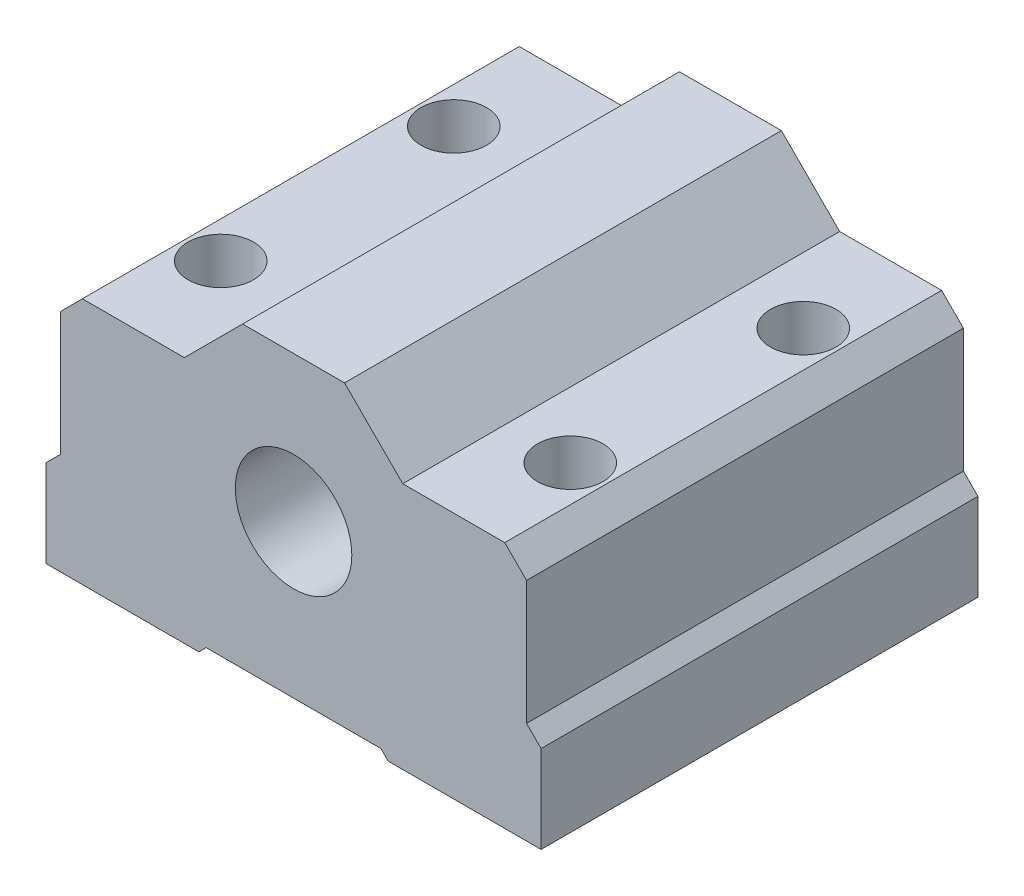
ISO-10303-21;
HEADER;
FILE_DESCRIPTION(('STEP AP214'),'2;1');
FILE_NAME('part.step','',(''),(''),'','','');
FILE_SCHEMA(('AUTOMOTIVE_DESIGN { 1 0 10303 214 1 1 1 1 }'));
ENDSEC;
DATA;
#1=APPLICATION_CONTEXT('core data for automotive mechanical design processes');
#2=APPLICATION_PROTOCOL_DEFINITION('international standard','automotive_design',2000,#1);
#3=PRODUCT_CONTEXT('',#1,'mechanical');
#4=PRODUCT('Part','Part','',(#3));
#5=PRODUCT_RELATED_PRODUCT_CATEGORY('part','',(#4));
#6=PRODUCT_DEFINITION_FORMATION('','',#4);
#7=PRODUCT_DEFINITION_CONTEXT('part definition',#1,'design');
#8=PRODUCT_DEFINITION('design','',#6,#7);
#9=PRODUCT_DEFINITION_SHAPE('','',#8);
#10=(LENGTH_UNIT() NAMED_UNIT(*) SI_UNIT(.MILLI.,.METRE.));
#11=(NAMED_UNIT(*) PLANE_ANGLE_UNIT() SI_UNIT($,.RADIAN.));
#12=(NAMED_UNIT(*) SI_UNIT($,.STERADIAN.) SOLID_ANGLE_UNIT());
#13=UNCERTAINTY_MEASURE_WITH_UNIT(LENGTH_MEASURE(1.E-05),#10,'distance_accuracy_value','');
#14=(GEOMETRIC_REPRESENTATION_CONTEXT(3) GLOBAL_UNCERTAINTY_ASSIGNED_CONTEXT((#13)) GLOBAL_UNIT_ASSIGNED_CONTEXT((#10,
#11,#12)) REPRESENTATION_CONTEXT('',''));
#15=CARTESIAN_POINT('',(0.,0.,0.));
#16=DIRECTION('',(0.,0.,1.));
#17=DIRECTION('',(1.,0.,0.));
#18=AXIS2_PLACEMENT_3D('',#15,#16,#17);
#19=CARTESIAN_POINT('',(-6.00000000000002,6.00000000000001,-15.));
#20=DIRECTION('',(-0.707106781186548,0.707106781186547,0.));
#21=DIRECTION('',(-0.707106781186547,-0.707106781186548,0.));
#22=AXIS2_PLACEMENT_3D('',#19,#20,#21);
#23=PLANE('',#22);
#24=DIRECTION('',(0.,0.,1.));
#25=VECTOR('',#24,1.);
#26=CARTESIAN_POINT('',(-17.,-5.,-15.));
#27=LINE('',#26,#25);
#28=CARTESIAN_POINT('',(-17.,-5.,-15.));
#29=VERTEX_POINT('',#28);
#30=CARTESIAN_POINT('',(-17.,-5.,15.));
#31=VERTEX_POINT('',#30);
#32=EDGE_CURVE('E39',#29,#31,#27,.T.);
#33=ORIENTED_EDGE('',*,*,#32,.T.);
#34=DIRECTION('',(-0.707106781186547,-0.707106781186548,0.));
#35=VECTOR('',#34,1.);
#36=CARTESIAN_POINT('',(-6.00000000000002,6.00000000000001,15.));
#37=LINE('',#36,#35);
#38=CARTESIAN_POINT('',(-16.,-4.,15.));
#39=VERTEX_POINT('',#38);
#40=EDGE_CURVE('E160',#39,#31,#37,.T.);
#41=ORIENTED_EDGE('',*,*,#40,.F.);
#42=DIRECTION('',(0.,0.,1.));
#43=VECTOR('',#42,1.);
#44=CARTESIAN_POINT('',(-16.,-4.,-15.));
#45=LINE('',#44,#43);
#46=CARTESIAN_POINT('',(-16.,-4.,-15.));
#47=VERTEX_POINT('',#46);
#48=EDGE_CURVE('E11',#47,#39,#45,.T.);
#49=ORIENTED_EDGE('',*,*,#48,.F.);
#50=DIRECTION('',(-0.707106781186547,-0.707106781186548,0.));
#51=VECTOR('',#50,1.);
#52=CARTESIAN_POINT('',(-6.00000000000002,6.00000000000001,-15.));
#53=LINE('',#52,#51);
#54=EDGE_CURVE('E161',#47,#29,#53,.T.);
#55=ORIENTED_EDGE('',*,*,#54,.T.);
#56=EDGE_LOOP('',(#33,#41,#49,#55));
#57=FACE_BOUND('',#56,.T.);
#58=ADVANCED_FACE('F35',(#57),#23,.T.);
#59=CARTESIAN_POINT('',(-16.,0.,-15.));
#60=DIRECTION('',(-1.,0.,0.));
#61=DIRECTION('',(0.,0.,1.));
#62=AXIS2_PLACEMENT_3D('',#59,#60,#61);
#63=PLANE('',#62);
#64=ORIENTED_EDGE('',*,*,#48,.T.);
#65=DIRECTION('',(0.,-1.,0.));
#66=VECTOR('',#65,1.);
#67=CARTESIAN_POINT('',(-16.,0.,15.));
#68=LINE('',#67,#66);
#69=CARTESIAN_POINT('',(-16.,4.5,15.));
#70=VERTEX_POINT('',#69);
#71=EDGE_CURVE('E178',#70,#39,#68,.T.);
#72=ORIENTED_EDGE('',*,*,#71,.F.);
#73=DIRECTION('',(0.,0.,1.));
#74=VECTOR('',#73,1.);
#75=CARTESIAN_POINT('',(-16.,4.5,-15.));
#76=LINE('',#75,#74);
#77=CARTESIAN_POINT('',(-16.,4.5,-15.));
#78=VERTEX_POINT('',#77);
#79=EDGE_CURVE('E44',#78,#70,#76,.T.);
#80=ORIENTED_EDGE('',*,*,#79,.F.);
#81=DIRECTION('',(0.,-1.,0.));
#82=VECTOR('',#81,1.);
#83=CARTESIAN_POINT('',(-16.,0.,-15.));
#84=LINE('',#83,#82);
#85=EDGE_CURVE('E166',#78,#47,#84,.T.);
#86=ORIENTED_EDGE('',*,*,#85,.T.);
#87=EDGE_LOOP('',(#64,#72,#80,#86));
#88=FACE_BOUND('',#87,.T.);
#89=ADVANCED_FACE('F370',(#88),#63,.T.);
#90=CARTESIAN_POINT('',(-10.25,10.25,-15.));
#91=DIRECTION('',(-0.707106781186547,0.707106781186547,0.));
#92=DIRECTION('',(-0.707106781186548,-0.707106781186548,0.));
#93=AXIS2_PLACEMENT_3D('',#90,#91,#92);
#94=PLANE('',#93);
#95=ORIENTED_EDGE('',*,*,#79,.T.);
#96=DIRECTION('',(-0.707106781186548,-0.707106781186548,0.));
#97=VECTOR('',#96,1.);
#98=CARTESIAN_POINT('',(-10.25,10.25,15.));
#99=LINE('',#98,#97);
#100=CARTESIAN_POINT('',(-14.5,6.,15.));
#101=VERTEX_POINT('',#100);
#102=EDGE_CURVE('E226',#101,#70,#99,.T.);
#103=ORIENTED_EDGE('',*,*,#102,.F.);
#104=DIRECTION('',(0.,0.,1.));
#105=VECTOR('',#104,1.);
#106=CARTESIAN_POINT('',(-14.5,6.,-15.));
#107=LINE('',#106,#105);
#108=CARTESIAN_POINT('',(-14.5,6.,-15.));
#109=VERTEX_POINT('',#108);
#110=EDGE_CURVE('E281',#109,#101,#107,.T.);
#111=ORIENTED_EDGE('',*,*,#110,.F.);
#112=DIRECTION('',(-0.707106781186548,-0.707106781186548,0.));
#113=VECTOR('',#112,1.);
#114=CARTESIAN_POINT('',(-10.25,10.25,-15.));
#115=LINE('',#114,#113);
#116=EDGE_CURVE('E277',#109,#78,#115,.T.);
#117=ORIENTED_EDGE('',*,*,#116,.T.);
#118=EDGE_LOOP('',(#95,#103,#111,#117));
#119=FACE_BOUND('',#118,.T.);
#120=ADVANCED_FACE('F368',(#119),#94,.T.);
#121=CARTESIAN_POINT('',(0.,6.,-15.));
#122=DIRECTION('',(0.,1.,0.));
#123=DIRECTION('',(0.,0.,1.));
#124=AXIS2_PLACEMENT_3D('',#121,#122,#123);
#125=PLANE('',#124);
#126=CARTESIAN_POINT('',(-12.,6.,-8.));
#127=DIRECTION('',(0.,1.,0.));
#128=DIRECTION('',(0.,0.,1.));
#129=AXIS2_PLACEMENT_3D('',#126,#127,#128);
#130=CIRCLE('',#129,2.24999999999999);
#131=CARTESIAN_POINT('',(-12.,6.,-5.75000000000001));
#132=VERTEX_POINT('',#131);
#133=EDGE_CURVE('E453',#132,#132,#130,.T.);
#134=ORIENTED_EDGE('',*,*,#133,.F.);
#135=EDGE_LOOP('',(#134));
#136=FACE_BOUND('',#135,.T.);
#137=CARTESIAN_POINT('',(-12.,6.,8.));
#138=DIRECTION('',(0.,1.,0.));
#139=DIRECTION('',(0.,0.,1.));
#140=AXIS2_PLACEMENT_3D('',#137,#138,#139);
#141=CIRCLE('',#140,2.24999999999999);
#142=CARTESIAN_POINT('',(-12.,6.,10.25));
#143=VERTEX_POINT('',#142);
#144=EDGE_CURVE('E469',#143,#143,#141,.T.);
#145=ORIENTED_EDGE('',*,*,#144,.F.);
#146=EDGE_LOOP('',(#145));
#147=FACE_BOUND('',#146,.T.);
#148=ORIENTED_EDGE('',*,*,#110,.T.);
#149=DIRECTION('',(-1.,0.,0.));
#150=VECTOR('',#149,1.);
#151=CARTESIAN_POINT('',(0.,6.,15.));
#152=LINE('',#151,#150);
#153=CARTESIAN_POINT('',(-7.5,6.,15.));
#154=VERTEX_POINT('',#153);
#155=EDGE_CURVE('E223',#154,#101,#152,.T.);
#156=ORIENTED_EDGE('',*,*,#155,.F.);
#157=DIRECTION('',(0.,0.,1.));
#158=VECTOR('',#157,1.);
#159=CARTESIAN_POINT('',(-7.5,6.,-15.));
#160=LINE('',#159,#158);
#161=CARTESIAN_POINT('',(-7.5,6.,-15.));
#162=VERTEX_POINT('',#161);
#163=EDGE_CURVE('E283',#162,#154,#160,.T.);
#164=ORIENTED_EDGE('',*,*,#163,.F.);
#165=DIRECTION('',(-1.,0.,0.));
#166=VECTOR('',#165,1.);
#167=CARTESIAN_POINT('',(0.,6.,-15.));
#168=LINE('',#167,#166);
#169=EDGE_CURVE('E274',#162,#109,#168,.T.);
#170=ORIENTED_EDGE('',*,*,#169,.T.);
#171=EDGE_LOOP('',(#148,#156,#164,#170));
#172=FACE_BOUND('',#171,.T.);
#173=ADVANCED_FACE('F366',(#136,#147,#172),#125,.T.);
#174=CARTESIAN_POINT('',(-6.75,6.75,-15.));
#175=DIRECTION('',(-0.707106781186548,0.707106781186547,0.));
#176=DIRECTION('',(-0.707106781186547,-0.707106781186548,0.));
#177=AXIS2_PLACEMENT_3D('',#174,#175,#176);
#178=PLANE('',#177);
#179=ORIENTED_EDGE('',*,*,#163,.T.);
#180=DIRECTION('',(-0.707106781186547,-0.707106781186548,0.));
#181=VECTOR('',#180,1.);
#182=CARTESIAN_POINT('',(-6.75,6.75,15.));
#183=LINE('',#182,#181);
#184=CARTESIAN_POINT('',(-3.5,10.,15.));
#185=VERTEX_POINT('',#184);
#186=EDGE_CURVE('E220',#185,#154,#183,.T.);
#187=ORIENTED_EDGE('',*,*,#186,.F.);
#188=DIRECTION('',(0.,0.,1.));
#189=VECTOR('',#188,1.);
#190=CARTESIAN_POINT('',(-3.5,10.,-15.));
#191=LINE('',#190,#189);
#192=CARTESIAN_POINT('',(-3.5,10.,-15.));
#193=VERTEX_POINT('',#192);
#194=EDGE_CURVE('E285',#193,#185,#191,.T.);
#195=ORIENTED_EDGE('',*,*,#194,.F.);
#196=DIRECTION('',(-0.707106781186547,-0.707106781186548,0.));
#197=VECTOR('',#196,1.);
#198=CARTESIAN_POINT('',(-6.75,6.75,-15.));
#199=LINE('',#198,#197);
#200=EDGE_CURVE('E271',#193,#162,#199,.T.);
#201=ORIENTED_EDGE('',*,*,#200,.T.);
#202=EDGE_LOOP('',(#179,#187,#195,#201));
#203=FACE_BOUND('',#202,.T.);
#204=ADVANCED_FACE('F361',(#203),#178,.T.);
#205=CARTESIAN_POINT('',(0.,10.,-15.));
#206=DIRECTION('',(0.,1.,0.));
#207=DIRECTION('',(0.,0.,1.));
#208=AXIS2_PLACEMENT_3D('',#205,#206,#207);
#209=PLANE('',#208);
#210=ORIENTED_EDGE('',*,*,#194,.T.);
#211=DIRECTION('',(-1.,0.,0.));
#212=VECTOR('',#211,1.);
#213=CARTESIAN_POINT('',(0.,10.,15.));
#214=LINE('',#213,#212);
#215=CARTESIAN_POINT('',(3.5,10.,15.));
#216=VERTEX_POINT('',#215);
#217=EDGE_CURVE('E217',#216,#185,#214,.T.);
#218=ORIENTED_EDGE('',*,*,#217,.F.);
#219=DIRECTION('',(0.,0.,1.));
#220=VECTOR('',#219,1.);
#221=CARTESIAN_POINT('',(3.5,10.,-15.));
#222=LINE('',#221,#220);
#223=CARTESIAN_POINT('',(3.5,10.,-15.));
#224=VERTEX_POINT('',#223);
#225=EDGE_CURVE('E287',#224,#216,#222,.T.);
#226=ORIENTED_EDGE('',*,*,#225,.F.);
#227=DIRECTION('',(-1.,0.,0.));
#228=VECTOR('',#227,1.);
#229=CARTESIAN_POINT('',(0.,10.,-15.));
#230=LINE('',#229,#228);
#231=EDGE_CURVE('E268',#224,#193,#230,.T.);
#232=ORIENTED_EDGE('',*,*,#231,.T.);
#233=EDGE_LOOP('',(#210,#218,#226,#232));
#234=FACE_BOUND('',#233,.T.);
#235=ADVANCED_FACE('F356',(#234),#209,.T.);
#236=CARTESIAN_POINT('',(6.75,6.75,-15.));
#237=DIRECTION('',(0.707106781186548,0.707106781186547,0.));
#238=DIRECTION('',(-0.707106781186547,0.707106781186548,0.));
#239=AXIS2_PLACEMENT_3D('',#236,#237,#238);
#240=PLANE('',#239);
#241=ORIENTED_EDGE('',*,*,#225,.T.);
#242=DIRECTION('',(-0.707106781186547,0.707106781186548,0.));
#243=VECTOR('',#242,1.);
#244=CARTESIAN_POINT('',(6.75,6.75,15.));
#245=LINE('',#244,#243);
#246=CARTESIAN_POINT('',(7.5,6.00000000000001,15.));
#247=VERTEX_POINT('',#246);
#248=EDGE_CURVE('E214',#247,#216,#245,.T.);
#249=ORIENTED_EDGE('',*,*,#248,.F.);
#250=DIRECTION('',(0.,0.,1.));
#251=VECTOR('',#250,1.);
#252=CARTESIAN_POINT('',(7.5,6.00000000000001,-15.));
#253=LINE('',#252,#251);
#254=CARTESIAN_POINT('',(7.5,6.00000000000001,-15.));
#255=VERTEX_POINT('',#254);
#256=EDGE_CURVE('E289',#255,#247,#253,.T.);
#257=ORIENTED_EDGE('',*,*,#256,.F.);
#258=DIRECTION('',(-0.707106781186547,0.707106781186548,0.));
#259=VECTOR('',#258,1.);
#260=CARTESIAN_POINT('',(6.75,6.75,-15.));
#261=LINE('',#260,#259);
#262=EDGE_CURVE('E265',#255,#224,#261,.T.);
#263=ORIENTED_EDGE('',*,*,#262,.T.);
#264=EDGE_LOOP('',(#241,#249,#257,#263));
#265=FACE_BOUND('',#264,.T.);
#266=ADVANCED_FACE('F354',(#265),#240,.T.);
#267=CARTESIAN_POINT('',(0.,6.,-15.));
#268=DIRECTION('',(0.,1.,0.));
#269=DIRECTION('',(-1.,0.,0.));
#270=AXIS2_PLACEMENT_3D('',#267,#268,#269);
#271=PLANE('',#270);
#272=CARTESIAN_POINT('',(12.,6.,-8.));
#273=DIRECTION('',(0.,1.,0.));
#274=DIRECTION('',(0.,0.,1.));
#275=AXIS2_PLACEMENT_3D('',#272,#273,#274);
#276=CIRCLE('',#275,2.24999999999999);
#277=CARTESIAN_POINT('',(12.,6.,-5.75000000000001));
#278=VERTEX_POINT('',#277);
#279=EDGE_CURVE('E455',#278,#278,#276,.T.);
#280=ORIENTED_EDGE('',*,*,#279,.F.);
#281=EDGE_LOOP('',(#280));
#282=FACE_BOUND('',#281,.T.);
#283=CARTESIAN_POINT('',(12.,6.,8.));
#284=DIRECTION('',(0.,1.,0.));
#285=DIRECTION('',(0.,0.,1.));
#286=AXIS2_PLACEMENT_3D('',#283,#284,#285);
#287=CIRCLE('',#286,2.24999999999999);
#288=CARTESIAN_POINT('',(12.,6.,10.25));
#289=VERTEX_POINT('',#288);
#290=EDGE_CURVE('E463',#289,#289,#287,.T.);
#291=ORIENTED_EDGE('',*,*,#290,.F.);
#292=EDGE_LOOP('',(#291));
#293=FACE_BOUND('',#292,.T.);
#294=ORIENTED_EDGE('',*,*,#256,.T.);
#295=DIRECTION('',(-1.,0.,0.));
#296=VECTOR('',#295,1.);
#297=CARTESIAN_POINT('',(0.,6.,15.));
#298=LINE('',#297,#296);
#299=CARTESIAN_POINT('',(14.5,6.00000000000001,15.));
#300=VERTEX_POINT('',#299);
#301=EDGE_CURVE('E211',#300,#247,#298,.T.);
#302=ORIENTED_EDGE('',*,*,#301,.F.);
#303=DIRECTION('',(0.,0.,1.));
#304=VECTOR('',#303,1.);
#305=CARTESIAN_POINT('',(14.5,6.00000000000001,-15.));
#306=LINE('',#305,#304);
#307=CARTESIAN_POINT('',(14.5,6.00000000000001,-15.));
#308=VERTEX_POINT('',#307);
#309=EDGE_CURVE('E291',#308,#300,#306,.T.);
#310=ORIENTED_EDGE('',*,*,#309,.F.);
#311=DIRECTION('',(-1.,0.,0.));
#312=VECTOR('',#311,1.);
#313=CARTESIAN_POINT('',(0.,6.,-15.));
#314=LINE('',#313,#312);
#315=EDGE_CURVE('E262',#308,#255,#314,.T.);
#316=ORIENTED_EDGE('',*,*,#315,.T.);
#317=EDGE_LOOP('',(#294,#302,#310,#316));
#318=FACE_BOUND('',#317,.T.);
#319=ADVANCED_FACE('F349',(#282,#293,#318),#271,.T.);
#320=CARTESIAN_POINT('',(10.25,10.25,-15.));
#321=DIRECTION('',(0.707106781186547,0.707106781186548,0.));
#322=DIRECTION('',(-0.707106781186548,0.707106781186547,0.));
#323=AXIS2_PLACEMENT_3D('',#320,#321,#322);
#324=PLANE('',#323);
#325=ORIENTED_EDGE('',*,*,#309,.T.);
#326=DIRECTION('',(-0.707106781186548,0.707106781186547,0.));
#327=VECTOR('',#326,1.);
#328=CARTESIAN_POINT('',(10.25,10.25,15.));
#329=LINE('',#328,#327);
#330=CARTESIAN_POINT('',(16.,4.50000000000001,15.));
#331=VERTEX_POINT('',#330);
#332=EDGE_CURVE('E208',#331,#300,#329,.T.);
#333=ORIENTED_EDGE('',*,*,#332,.F.);
#334=DIRECTION('',(0.,0.,1.));
#335=VECTOR('',#334,1.);
#336=CARTESIAN_POINT('',(16.,4.50000000000001,-15.));
#337=LINE('',#336,#335);
#338=CARTESIAN_POINT('',(16.,4.50000000000001,-15.));
#339=VERTEX_POINT('',#338);
#340=EDGE_CURVE('E293',#339,#331,#337,.T.);
#341=ORIENTED_EDGE('',*,*,#340,.F.);
#342=DIRECTION('',(-0.707106781186548,0.707106781186547,0.));
#343=VECTOR('',#342,1.);
#344=CARTESIAN_POINT('',(10.25,10.25,-15.));
#345=LINE('',#344,#343);
#346=EDGE_CURVE('E259',#339,#308,#345,.T.);
#347=ORIENTED_EDGE('',*,*,#346,.T.);
#348=EDGE_LOOP('',(#325,#333,#341,#347));
#349=FACE_BOUND('',#348,.T.);
#350=ADVANCED_FACE('F344',(#349),#324,.T.);
#351=CARTESIAN_POINT('',(16.,0.,-15.));
#352=DIRECTION('',(1.,0.,0.));
#353=DIRECTION('',(0.,0.,-1.));
#354=AXIS2_PLACEMENT_3D('',#351,#352,#353);
#355=PLANE('',#354);
#356=ORIENTED_EDGE('',*,*,#340,.T.);
#357=DIRECTION('',(0.,1.,0.));
#358=VECTOR('',#357,1.);
#359=CARTESIAN_POINT('',(16.,0.,15.));
#360=LINE('',#359,#358);
#361=CARTESIAN_POINT('',(16.,-3.99999999999999,15.));
#362=VERTEX_POINT('',#361);
#363=EDGE_CURVE('E205',#362,#331,#360,.T.);
#364=ORIENTED_EDGE('',*,*,#363,.F.);
#365=DIRECTION('',(0.,0.,1.));
#366=VECTOR('',#365,1.);
#367=CARTESIAN_POINT('',(16.,-3.99999999999999,-15.));
#368=LINE('',#367,#366);
#369=CARTESIAN_POINT('',(16.,-3.99999999999999,-15.));
#370=VERTEX_POINT('',#369);
#371=EDGE_CURVE('E295',#370,#362,#368,.T.);
#372=ORIENTED_EDGE('',*,*,#371,.F.);
#373=DIRECTION('',(0.,1.,0.));
#374=VECTOR('',#373,1.);
#375=CARTESIAN_POINT('',(16.,0.,-15.));
#376=LINE('',#375,#374);
#377=EDGE_CURVE('E256',#370,#339,#376,.T.);
#378=ORIENTED_EDGE('',*,*,#377,.T.);
#379=EDGE_LOOP('',(#356,#364,#372,#378));
#380=FACE_BOUND('',#379,.T.);
#381=ADVANCED_FACE('F342',(#380),#355,.T.);
#382=CARTESIAN_POINT('',(6.00000000000006,6.00000000000002,-15.));
#383=DIRECTION('',(0.70710678118655,0.707106781186545,0.));
#384=DIRECTION('',(-0.707106781186545,0.70710678118655,0.));
#385=AXIS2_PLACEMENT_3D('',#382,#383,#384);
#386=PLANE('',#385);
#387=ORIENTED_EDGE('',*,*,#371,.T.);
#388=DIRECTION('',(-0.707106781186545,0.70710678118655,0.));
#389=VECTOR('',#388,1.);
#390=CARTESIAN_POINT('',(6.00000000000006,6.00000000000002,15.));
#391=LINE('',#390,#389);
#392=CARTESIAN_POINT('',(17.,-5.,15.));
#393=VERTEX_POINT('',#392);
#394=EDGE_CURVE('E202',#393,#362,#391,.T.);
#395=ORIENTED_EDGE('',*,*,#394,.F.);
#396=DIRECTION('',(0.,0.,1.));
#397=VECTOR('',#396,1.);
#398=CARTESIAN_POINT('',(17.,-5.,-15.));
#399=LINE('',#398,#397);
#400=CARTESIAN_POINT('',(17.,-5.,-15.));
#401=VERTEX_POINT('',#400);
#402=EDGE_CURVE('E297',#401,#393,#399,.T.);
#403=ORIENTED_EDGE('',*,*,#402,.F.);
#404=DIRECTION('',(-0.707106781186545,0.70710678118655,0.));
#405=VECTOR('',#404,1.);
#406=CARTESIAN_POINT('',(6.00000000000006,6.00000000000002,-15.));
#407=LINE('',#406,#405);
#408=EDGE_CURVE('E253',#401,#370,#407,.T.);
#409=ORIENTED_EDGE('',*,*,#408,.T.);
#410=EDGE_LOOP('',(#387,#395,#403,#409));
#411=FACE_BOUND('',#410,.T.);
#412=ADVANCED_FACE('F337',(#411),#386,.T.);
#413=CARTESIAN_POINT('',(17.,0.,-15.));
#414=DIRECTION('',(1.,0.,0.));
#415=DIRECTION('',(0.,0.,-1.));
#416=AXIS2_PLACEMENT_3D('',#413,#414,#415);
#417=PLANE('',#416);
#418=ORIENTED_EDGE('',*,*,#402,.T.);
#419=DIRECTION('',(0.,1.,0.));
#420=VECTOR('',#419,1.);
#421=CARTESIAN_POINT('',(17.,0.,15.));
#422=LINE('',#421,#420);
#423=CARTESIAN_POINT('',(17.,-11.,15.));
#424=VERTEX_POINT('',#423);
#425=EDGE_CURVE('E199',#424,#393,#422,.T.);
#426=ORIENTED_EDGE('',*,*,#425,.F.);
#427=DIRECTION('',(0.,0.,1.));
#428=VECTOR('',#427,1.);
#429=CARTESIAN_POINT('',(17.,-11.,-15.));
#430=LINE('',#429,#428);
#431=CARTESIAN_POINT('',(17.,-11.,-15.));
#432=VERTEX_POINT('',#431);
#433=EDGE_CURVE('E299',#432,#424,#430,.T.);
#434=ORIENTED_EDGE('',*,*,#433,.F.);
#435=DIRECTION('',(0.,1.,0.));
#436=VECTOR('',#435,1.);
#437=CARTESIAN_POINT('',(17.,0.,-15.));
#438=LINE('',#437,#436);
#439=EDGE_CURVE('E250',#432,#401,#438,.T.);
#440=ORIENTED_EDGE('',*,*,#439,.T.);
#441=EDGE_LOOP('',(#418,#426,#434,#440));
#442=FACE_BOUND('',#441,.T.);
#443=ADVANCED_FACE('F332',(#442),#417,.T.);
#444=CARTESIAN_POINT('',(0.,-11.,-15.));
#445=DIRECTION('',(0.,-1.,0.));
#446=DIRECTION('',(1.,0.,0.));
#447=AXIS2_PLACEMENT_3D('',#444,#445,#446);
#448=PLANE('',#447);
#449=CARTESIAN_POINT('',(12.,-11.,-8.));
#450=DIRECTION('',(0.,1.,0.));
#451=DIRECTION('',(0.,0.,1.));
#452=AXIS2_PLACEMENT_3D('',#449,#450,#451);
#453=CIRCLE('',#452,2.25);
#454=CARTESIAN_POINT('',(12.,-11.,-5.75));
#455=VERTEX_POINT('',#454);
#456=EDGE_CURVE('E460',#455,#455,#453,.T.);
#457=ORIENTED_EDGE('',*,*,#456,.T.);
#458=EDGE_LOOP('',(#457));
#459=FACE_BOUND('',#458,.T.);
#460=CARTESIAN_POINT('',(12.,-11.,8.));
#461=DIRECTION('',(0.,1.,0.));
#462=DIRECTION('',(0.,0.,1.));
#463=AXIS2_PLACEMENT_3D('',#460,#461,#462);
#464=CIRCLE('',#463,2.25);
#465=CARTESIAN_POINT('',(12.,-11.,10.25));
#466=VERTEX_POINT('',#465);
#467=EDGE_CURVE('E466',#466,#466,#464,.T.);
#468=ORIENTED_EDGE('',*,*,#467,.T.);
#469=EDGE_LOOP('',(#468));
#470=FACE_BOUND('',#469,.T.);
#471=ORIENTED_EDGE('',*,*,#433,.T.);
#472=DIRECTION('',(1.,0.,0.));
#473=VECTOR('',#472,1.);
#474=CARTESIAN_POINT('',(0.,-11.,15.));
#475=LINE('',#474,#473);
#476=CARTESIAN_POINT('',(6.5,-11.,15.));
#477=VERTEX_POINT('',#476);
#478=EDGE_CURVE('E196',#477,#424,#475,.T.);
#479=ORIENTED_EDGE('',*,*,#478,.F.);
#480=DIRECTION('',(0.,0.,1.));
#481=VECTOR('',#480,1.);
#482=CARTESIAN_POINT('',(6.5,-11.,-15.));
#483=LINE('',#482,#481);
#484=CARTESIAN_POINT('',(6.5,-11.,-15.));
#485=VERTEX_POINT('',#484);
#486=EDGE_CURVE('E301',#485,#477,#483,.T.);
#487=ORIENTED_EDGE('',*,*,#486,.F.);
#488=DIRECTION('',(1.,0.,0.));
#489=VECTOR('',#488,1.);
#490=CARTESIAN_POINT('',(0.,-11.,-15.));
#491=LINE('',#490,#489);
#492=EDGE_CURVE('E247',#485,#432,#491,.T.);
#493=ORIENTED_EDGE('',*,*,#492,.T.);
#494=EDGE_LOOP('',(#471,#479,#487,#493));
#495=FACE_BOUND('',#494,.T.);
#496=ADVANCED_FACE('F330',(#459,#470,#495),#448,.T.);
#497=CARTESIAN_POINT('',(-2.25,-2.25,-15.));
#498=DIRECTION('',(-0.707106781186547,-0.707106781186547,0.));
#499=DIRECTION('',(0.707106781186548,-0.707106781186548,0.));
#500=AXIS2_PLACEMENT_3D('',#497,#498,#499);
#501=PLANE('',#500);
#502=ORIENTED_EDGE('',*,*,#486,.T.);
#503=DIRECTION('',(0.707106781186548,-0.707106781186548,0.));
#504=VECTOR('',#503,1.);
#505=CARTESIAN_POINT('',(-2.25,-2.25,15.));
#506=LINE('',#505,#504);
#507=CARTESIAN_POINT('',(6.,-10.5,15.));
#508=VERTEX_POINT('',#507);
#509=EDGE_CURVE('E193',#508,#477,#506,.T.);
#510=ORIENTED_EDGE('',*,*,#509,.F.);
#511=DIRECTION('',(0.,0.,1.));
#512=VECTOR('',#511,1.);
#513=CARTESIAN_POINT('',(6.,-10.5,-15.));
#514=LINE('',#513,#512);
#515=CARTESIAN_POINT('',(6.,-10.5,-15.));
#516=VERTEX_POINT('',#515);
#517=EDGE_CURVE('E303',#516,#508,#514,.T.);
#518=ORIENTED_EDGE('',*,*,#517,.F.);
#519=DIRECTION('',(0.707106781186548,-0.707106781186548,0.));
#520=VECTOR('',#519,1.);
#521=CARTESIAN_POINT('',(-2.25,-2.25,-15.));
#522=LINE('',#521,#520);
#523=EDGE_CURVE('E244',#516,#485,#522,.T.);
#524=ORIENTED_EDGE('',*,*,#523,.T.);
#525=EDGE_LOOP('',(#502,#510,#518,#524));
#526=FACE_BOUND('',#525,.T.);
#527=ADVANCED_FACE('F325',(#526),#501,.T.);
#528=CARTESIAN_POINT('',(0.,-10.5,-15.));
#529=DIRECTION('',(0.,-1.,0.));
#530=DIRECTION('',(1.,0.,0.));
#531=AXIS2_PLACEMENT_3D('',#528,#529,#530);
#532=PLANE('',#531);
#533=ORIENTED_EDGE('',*,*,#517,.T.);
#534=DIRECTION('',(1.,0.,0.));
#535=VECTOR('',#534,1.);
#536=CARTESIAN_POINT('',(0.,-10.5,15.));
#537=LINE('',#536,#535);
#538=CARTESIAN_POINT('',(-6.,-10.5,15.));
#539=VERTEX_POINT('',#538);
#540=EDGE_CURVE('E190',#539,#508,#537,.T.);
#541=ORIENTED_EDGE('',*,*,#540,.F.);
#542=DIRECTION('',(0.,0.,1.));
#543=VECTOR('',#542,1.);
#544=CARTESIAN_POINT('',(-6.,-10.5,-15.));
#545=LINE('',#544,#543);
#546=CARTESIAN_POINT('',(-6.,-10.5,-15.));
#547=VERTEX_POINT('',#546);
#548=EDGE_CURVE('E305',#547,#539,#545,.T.);
#549=ORIENTED_EDGE('',*,*,#548,.F.);
#550=DIRECTION('',(1.,0.,0.));
#551=VECTOR('',#550,1.);
#552=CARTESIAN_POINT('',(0.,-10.5,-15.));
#553=LINE('',#552,#551);
#554=EDGE_CURVE('E241',#547,#516,#553,.T.);
#555=ORIENTED_EDGE('',*,*,#554,.T.);
#556=EDGE_LOOP('',(#533,#541,#549,#555));
#557=FACE_BOUND('',#556,.T.);
#558=ADVANCED_FACE('F318',(#557),#532,.T.);
#559=CARTESIAN_POINT('',(2.25,-2.25,-15.));
#560=DIRECTION('',(0.707106781186547,-0.707106781186547,0.));
#561=DIRECTION('',(0.707106781186548,0.707106781186548,0.));
#562=AXIS2_PLACEMENT_3D('',#559,#560,#561);
#563=PLANE('',#562);
#564=ORIENTED_EDGE('',*,*,#548,.T.);
#565=DIRECTION('',(0.707106781186548,0.707106781186548,0.));
#566=VECTOR('',#565,1.);
#567=CARTESIAN_POINT('',(2.25,-2.25,15.));
#568=LINE('',#567,#566);
#569=CARTESIAN_POINT('',(-6.5,-11.,15.));
#570=VERTEX_POINT('',#569);
#571=EDGE_CURVE('E187',#570,#539,#568,.T.);
#572=ORIENTED_EDGE('',*,*,#571,.F.);
#573=DIRECTION('',(0.,0.,1.));
#574=VECTOR('',#573,1.);
#575=CARTESIAN_POINT('',(-6.5,-11.,-15.));
#576=LINE('',#575,#574);
#577=CARTESIAN_POINT('',(-6.5,-11.,-15.));
#578=VERTEX_POINT('',#577);
#579=EDGE_CURVE('E307',#578,#570,#576,.T.);
#580=ORIENTED_EDGE('',*,*,#579,.F.);
#581=DIRECTION('',(0.707106781186548,0.707106781186548,0.));
#582=VECTOR('',#581,1.);
#583=CARTESIAN_POINT('',(2.25,-2.25,-15.));
#584=LINE('',#583,#582);
#585=EDGE_CURVE('E238',#578,#547,#584,.T.);
#586=ORIENTED_EDGE('',*,*,#585,.T.);
#587=EDGE_LOOP('',(#564,#572,#580,#586));
#588=FACE_BOUND('',#587,.T.);
#589=ADVANCED_FACE('F315',(#588),#563,.T.);
#590=CARTESIAN_POINT('',(0.,-11.,-15.));
#591=DIRECTION('',(0.,-1.,0.));
#592=DIRECTION('',(1.,0.,0.));
#593=AXIS2_PLACEMENT_3D('',#590,#591,#592);
#594=PLANE('',#593);
#595=CARTESIAN_POINT('',(-12.,-11.,-8.));
#596=DIRECTION('',(0.,1.,0.));
#597=DIRECTION('',(0.,0.,1.));
#598=AXIS2_PLACEMENT_3D('',#595,#596,#597);
#599=CIRCLE('',#598,2.25);
#600=CARTESIAN_POINT('',(-12.,-11.,-5.75));
#601=VERTEX_POINT('',#600);
#602=EDGE_CURVE('E450',#601,#601,#599,.T.);
#603=ORIENTED_EDGE('',*,*,#602,.T.);
#604=EDGE_LOOP('',(#603));
#605=FACE_BOUND('',#604,.T.);
#606=CARTESIAN_POINT('',(-12.,-11.,8.));
#607=DIRECTION('',(0.,1.,0.));
#608=DIRECTION('',(0.,0.,1.));
#609=AXIS2_PLACEMENT_3D('',#606,#607,#608);
#610=CIRCLE('',#609,2.25);
#611=CARTESIAN_POINT('',(-12.,-11.,10.25));
#612=VERTEX_POINT('',#611);
#613=EDGE_CURVE('E182',#612,#612,#610,.T.);
#614=ORIENTED_EDGE('',*,*,#613,.T.);
#615=EDGE_LOOP('',(#614));
#616=FACE_BOUND('',#615,.T.);
#617=ORIENTED_EDGE('',*,*,#579,.T.);
#618=DIRECTION('',(1.,0.,0.));
#619=VECTOR('',#618,1.);
#620=CARTESIAN_POINT('',(0.,-11.,15.));
#621=LINE('',#620,#619);
#622=CARTESIAN_POINT('',(-17.,-11.,15.));
#623=VERTEX_POINT('',#622);
#624=EDGE_CURVE('E173',#623,#570,#621,.T.);
#625=ORIENTED_EDGE('',*,*,#624,.F.);
#626=DIRECTION('',(0.,0.,1.));
#627=VECTOR('',#626,1.);
#628=CARTESIAN_POINT('',(-17.,-11.,-15.));
#629=LINE('',#628,#627);
#630=CARTESIAN_POINT('',(-17.,-11.,-15.));
#631=VERTEX_POINT('',#630);
#632=EDGE_CURVE('E165',#631,#623,#629,.T.);
#633=ORIENTED_EDGE('',*,*,#632,.F.);
#634=DIRECTION('',(1.,0.,0.));
#635=VECTOR('',#634,1.);
#636=CARTESIAN_POINT('',(0.,-11.,-15.));
#637=LINE('',#636,#635);
#638=EDGE_CURVE('E235',#631,#578,#637,.T.);
#639=ORIENTED_EDGE('',*,*,#638,.T.);
#640=EDGE_LOOP('',(#617,#625,#633,#639));
#641=FACE_BOUND('',#640,.T.);
#642=ADVANCED_FACE('F309',(#605,#616,#641),#594,.T.);
#643=CARTESIAN_POINT('',(0.,0.,-15.));
#644=DIRECTION('',(0.,0.,1.));
#645=DIRECTION('',(1.,0.,0.));
#646=AXIS2_PLACEMENT_3D('',#643,#644,#645);
#647=CYLINDRICAL_SURFACE('',#646,4.);
#648=CARTESIAN_POINT('',(0.,0.,-15.));
#649=DIRECTION('',(0.,0.,1.));
#650=DIRECTION('',(1.,0.,0.));
#651=AXIS2_PLACEMENT_3D('',#648,#649,#650);
#652=CIRCLE('',#651,4.);
#653=CARTESIAN_POINT('',(4.,0.,-15.));
#654=VERTEX_POINT('',#653);
#655=EDGE_CURVE('E229',#654,#654,#652,.T.);
#656=ORIENTED_EDGE('',*,*,#655,.F.);
#657=EDGE_LOOP('',(#656));
#658=FACE_BOUND('',#657,.T.);
#659=CARTESIAN_POINT('',(0.,0.,15.));
#660=DIRECTION('',(0.,0.,1.));
#661=DIRECTION('',(1.,0.,0.));
#662=AXIS2_PLACEMENT_3D('',#659,#660,#661);
#663=CIRCLE('',#662,4.);
#664=CARTESIAN_POINT('',(4.,0.,15.));
#665=VERTEX_POINT('',#664);
#666=EDGE_CURVE('E179',#665,#665,#663,.T.);
#667=ORIENTED_EDGE('',*,*,#666,.T.);
#668=EDGE_LOOP('',(#667));
#669=FACE_BOUND('',#668,.T.);
#670=ADVANCED_FACE('F37',(#658,#669),#647,.F.);
#671=CARTESIAN_POINT('',(-17.,0.,-15.));
#672=DIRECTION('',(-1.,0.,0.));
#673=DIRECTION('',(0.,-1.,0.));
#674=AXIS2_PLACEMENT_3D('',#671,#672,#673);
#675=PLANE('',#674);
#676=ORIENTED_EDGE('',*,*,#632,.T.);
#677=DIRECTION('',(0.,-1.,0.));
#678=VECTOR('',#677,1.);
#679=CARTESIAN_POINT('',(-17.,0.,15.));
#680=LINE('',#679,#678);
#681=EDGE_CURVE('E168',#31,#623,#680,.T.);
#682=ORIENTED_EDGE('',*,*,#681,.F.);
#683=ORIENTED_EDGE('',*,*,#32,.F.);
#684=DIRECTION('',(0.,-1.,0.));
#685=VECTOR('',#684,1.);
#686=CARTESIAN_POINT('',(-17.,0.,-15.));
#687=LINE('',#686,#685);
#688=EDGE_CURVE('E233',#29,#631,#687,.T.);
#689=ORIENTED_EDGE('',*,*,#688,.T.);
#690=EDGE_LOOP('',(#676,#682,#683,#689));
#691=FACE_BOUND('',#690,.T.);
#692=ADVANCED_FACE('F169',(#691),#675,.T.);
#693=CARTESIAN_POINT('',(0.,0.,-15.));
#694=DIRECTION('',(0.,0.,1.));
#695=DIRECTION('',(1.,0.,0.));
#696=AXIS2_PLACEMENT_3D('',#693,#694,#695);
#697=PLANE('',#696);
#698=ORIENTED_EDGE('',*,*,#655,.T.);
#699=EDGE_LOOP('',(#698));
#700=FACE_BOUND('',#699,.T.);
#701=ORIENTED_EDGE('',*,*,#54,.F.);
#702=ORIENTED_EDGE('',*,*,#85,.F.);
#703=ORIENTED_EDGE('',*,*,#116,.F.);
#704=ORIENTED_EDGE('',*,*,#169,.F.);
#705=ORIENTED_EDGE('',*,*,#200,.F.);
#706=ORIENTED_EDGE('',*,*,#231,.F.);
#707=ORIENTED_EDGE('',*,*,#262,.F.);
#708=ORIENTED_EDGE('',*,*,#315,.F.);
#709=ORIENTED_EDGE('',*,*,#346,.F.);
#710=ORIENTED_EDGE('',*,*,#377,.F.);
#711=ORIENTED_EDGE('',*,*,#408,.F.);
#712=ORIENTED_EDGE('',*,*,#439,.F.);
#713=ORIENTED_EDGE('',*,*,#492,.F.);
#714=ORIENTED_EDGE('',*,*,#523,.F.);
#715=ORIENTED_EDGE('',*,*,#554,.F.);
#716=ORIENTED_EDGE('',*,*,#585,.F.);
#717=ORIENTED_EDGE('',*,*,#638,.F.);
#718=ORIENTED_EDGE('',*,*,#688,.F.);
#719=EDGE_LOOP('',(#701,#702,#703,#704,#705,#706,#707,#708,#709,#710,#711,#712,#713,#714,#715,
#716,#717,#718));
#720=FACE_BOUND('',#719,.T.);
#721=ADVANCED_FACE('F321',(#700,#720),#697,.F.);
#722=CARTESIAN_POINT('',(0.,0.,15.));
#723=DIRECTION('',(0.,0.,1.));
#724=DIRECTION('',(1.,0.,0.));
#725=AXIS2_PLACEMENT_3D('',#722,#723,#724);
#726=PLANE('',#725);
#727=ORIENTED_EDGE('',*,*,#666,.F.);
#728=EDGE_LOOP('',(#727));
#729=FACE_BOUND('',#728,.T.);
#730=ORIENTED_EDGE('',*,*,#40,.T.);
#731=ORIENTED_EDGE('',*,*,#681,.T.);
#732=ORIENTED_EDGE('',*,*,#624,.T.);
#733=ORIENTED_EDGE('',*,*,#571,.T.);
#734=ORIENTED_EDGE('',*,*,#540,.T.);
#735=ORIENTED_EDGE('',*,*,#509,.T.);
#736=ORIENTED_EDGE('',*,*,#478,.T.);
#737=ORIENTED_EDGE('',*,*,#425,.T.);
#738=ORIENTED_EDGE('',*,*,#394,.T.);
#739=ORIENTED_EDGE('',*,*,#363,.T.);
#740=ORIENTED_EDGE('',*,*,#332,.T.);
#741=ORIENTED_EDGE('',*,*,#301,.T.);
#742=ORIENTED_EDGE('',*,*,#248,.T.);
#743=ORIENTED_EDGE('',*,*,#217,.T.);
#744=ORIENTED_EDGE('',*,*,#186,.T.);
#745=ORIENTED_EDGE('',*,*,#155,.T.);
#746=ORIENTED_EDGE('',*,*,#102,.T.);
#747=ORIENTED_EDGE('',*,*,#71,.T.);
#748=EDGE_LOOP('',(#730,#731,#732,#733,#734,#735,#736,#737,#738,#739,#740,#741,#742,#743,#744,
#745,#746,#747));
#749=FACE_BOUND('',#748,.T.);
#750=ADVANCED_FACE('F176',(#729,#749),#726,.T.);
#751=CARTESIAN_POINT('',(-12.,6.,8.));
#752=DIRECTION('',(0.,1.,0.));
#753=DIRECTION('',(0.,0.,1.));
#754=AXIS2_PLACEMENT_3D('',#751,#752,#753);
#755=CYLINDRICAL_SURFACE('',#754,2.24999999999999);
#756=ORIENTED_EDGE('',*,*,#613,.F.);
#757=EDGE_LOOP('',(#756));
#758=FACE_BOUND('',#757,.T.);
#759=ORIENTED_EDGE('',*,*,#144,.T.);
#760=EDGE_LOOP('',(#759));
#761=FACE_BOUND('',#760,.T.);
#762=ADVANCED_FACE('F427',(#758,#761),#755,.F.);
#763=CARTESIAN_POINT('',(12.,6.,8.));
#764=DIRECTION('',(0.,1.,0.));
#765=DIRECTION('',(0.,0.,1.));
#766=AXIS2_PLACEMENT_3D('',#763,#764,#765);
#767=CYLINDRICAL_SURFACE('',#766,2.24999999999999);
#768=ORIENTED_EDGE('',*,*,#467,.F.);
#769=EDGE_LOOP('',(#768));
#770=FACE_BOUND('',#769,.T.);
#771=ORIENTED_EDGE('',*,*,#290,.T.);
#772=EDGE_LOOP('',(#771));
#773=FACE_BOUND('',#772,.T.);
#774=ADVANCED_FACE('F431',(#770,#773),#767,.F.);
#775=CARTESIAN_POINT('',(12.,6.,-8.));
#776=DIRECTION('',(0.,1.,0.));
#777=DIRECTION('',(0.,0.,1.));
#778=AXIS2_PLACEMENT_3D('',#775,#776,#777);
#779=CYLINDRICAL_SURFACE('',#778,2.24999999999999);
#780=ORIENTED_EDGE('',*,*,#456,.F.);
#781=EDGE_LOOP('',(#780));
#782=FACE_BOUND('',#781,.T.);
#783=ORIENTED_EDGE('',*,*,#279,.T.);
#784=EDGE_LOOP('',(#783));
#785=FACE_BOUND('',#784,.T.);
#786=ADVANCED_FACE('F437',(#782,#785),#779,.F.);
#787=CARTESIAN_POINT('',(-12.,6.,-8.));
#788=DIRECTION('',(0.,1.,0.));
#789=DIRECTION('',(0.,0.,1.));
#790=AXIS2_PLACEMENT_3D('',#787,#788,#789);
#791=CYLINDRICAL_SURFACE('',#790,2.24999999999999);
#792=ORIENTED_EDGE('',*,*,#602,.F.);
#793=EDGE_LOOP('',(#792));
#794=FACE_BOUND('',#793,.T.);
#795=ORIENTED_EDGE('',*,*,#133,.T.);
#796=EDGE_LOOP('',(#795));
#797=FACE_BOUND('',#796,.T.);
#798=ADVANCED_FACE('F441',(#794,#797),#791,.F.);
#799=CLOSED_SHELL('',(#58,#89,#120,#173,#204,#235,#266,#319,#350,#381,#412,#443,#496,#527,#558,
#589,#642,#670,#692,#721,#750,#762,#774,#786,#798));
#800=MANIFOLD_SOLID_BREP('B2',#799);
#801=ADVANCED_BREP_SHAPE_REPRESENTATION('',(#18,#800),#14);
#802=SHAPE_DEFINITION_REPRESENTATION(#9,#801);
ENDSEC;
END-ISO-10303-21;
